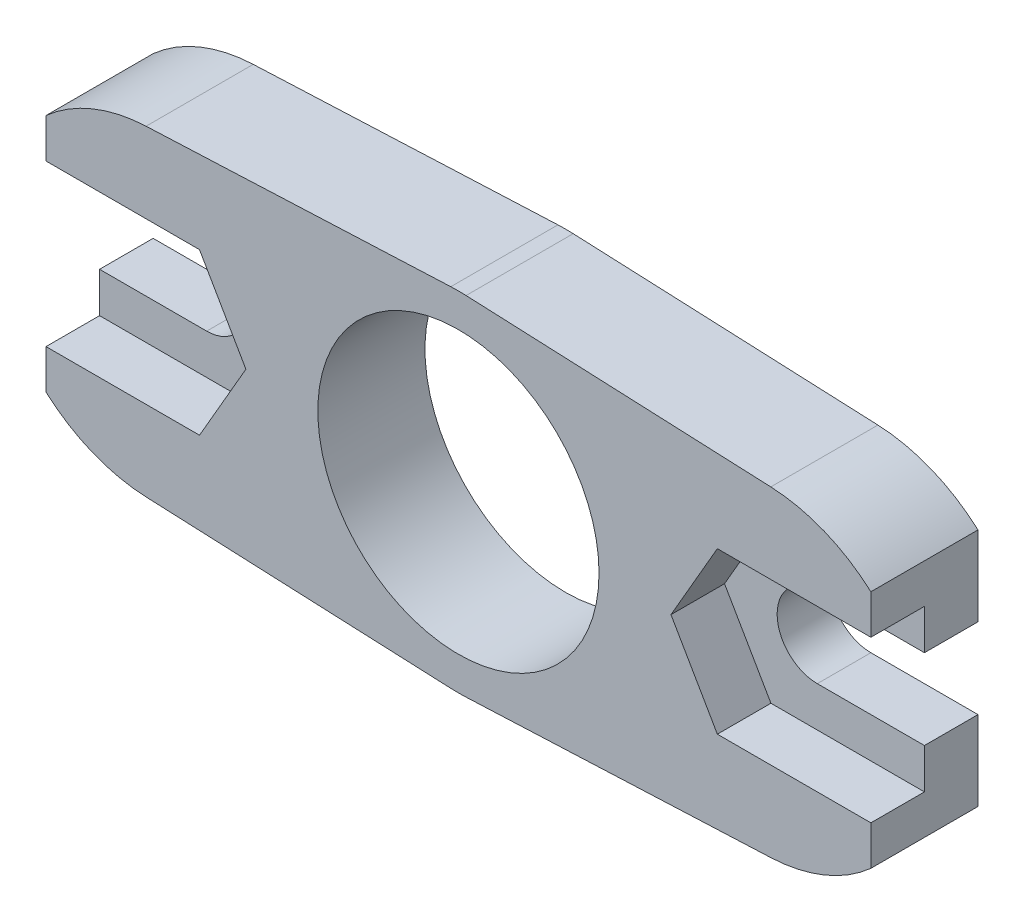
ISO-10303-21;
HEADER;
FILE_DESCRIPTION(('STEP AP214'),'2;1');
FILE_NAME('part.step','',(''),(''),'','','');
FILE_SCHEMA(('AUTOMOTIVE_DESIGN { 1 0 10303 214 1 1 1 1 }'));
ENDSEC;
DATA;
#1=APPLICATION_CONTEXT('core data for automotive mechanical design processes');
#2=APPLICATION_PROTOCOL_DEFINITION('international standard','automotive_design',2000,#1);
#3=PRODUCT_CONTEXT('',#1,'mechanical');
#4=PRODUCT('Part','Part','',(#3));
#5=PRODUCT_RELATED_PRODUCT_CATEGORY('part','',(#4));
#6=PRODUCT_DEFINITION_FORMATION('','',#4);
#7=PRODUCT_DEFINITION_CONTEXT('part definition',#1,'design');
#8=PRODUCT_DEFINITION('design','',#6,#7);
#9=PRODUCT_DEFINITION_SHAPE('','',#8);
#10=(LENGTH_UNIT() NAMED_UNIT(*) SI_UNIT(.MILLI.,.METRE.));
#11=(NAMED_UNIT(*) PLANE_ANGLE_UNIT() SI_UNIT($,.RADIAN.));
#12=(NAMED_UNIT(*) SI_UNIT($,.STERADIAN.) SOLID_ANGLE_UNIT());
#13=UNCERTAINTY_MEASURE_WITH_UNIT(LENGTH_MEASURE(1.E-05),#10,'distance_accuracy_value','');
#14=(GEOMETRIC_REPRESENTATION_CONTEXT(3) GLOBAL_UNCERTAINTY_ASSIGNED_CONTEXT((#13)) GLOBAL_UNIT_ASSIGNED_CONTEXT((#10,
#11,#12)) REPRESENTATION_CONTEXT('',''));
#15=CARTESIAN_POINT('',(0.,0.,0.));
#16=DIRECTION('',(0.,0.,1.));
#17=DIRECTION('',(1.,0.,0.));
#18=AXIS2_PLACEMENT_3D('',#15,#16,#17);
#19=CARTESIAN_POINT('',(-159.4,-141.5,6.));
#20=DIRECTION('',(0.,0.,-1.));
#21=DIRECTION('',(-1.,0.,0.));
#22=AXIS2_PLACEMENT_3D('',#19,#20,#21);
#23=CYLINDRICAL_SURFACE('',#22,1.49999999999999);
#24=DIRECTION('',(0.,0.,-1.));
#25=VECTOR('',#24,1.);
#26=CARTESIAN_POINT('',(-159.4,-140.,6.));
#27=LINE('',#26,#25);
#28=CARTESIAN_POINT('',(-159.4,-140.,4.));
#29=VERTEX_POINT('',#28);
#30=CARTESIAN_POINT('',(-159.4,-140.,2.));
#31=VERTEX_POINT('',#30);
#32=EDGE_CURVE('E430',#29,#31,#27,.T.);
#33=ORIENTED_EDGE('',*,*,#32,.T.);
#34=CARTESIAN_POINT('',(-159.4,-141.5,2.));
#35=DIRECTION('',(0.,0.,1.));
#36=DIRECTION('',(0.,-1.,0.));
#37=AXIS2_PLACEMENT_3D('',#34,#35,#36);
#38=CIRCLE('',#37,1.49999999999999);
#39=CARTESIAN_POINT('',(-159.4,-143.,2.));
#40=VERTEX_POINT('',#39);
#41=EDGE_CURVE('E308',#31,#40,#38,.F.);
#42=ORIENTED_EDGE('',*,*,#41,.T.);
#43=DIRECTION('',(0.,0.,-1.));
#44=VECTOR('',#43,1.);
#45=CARTESIAN_POINT('',(-159.4,-143.,6.));
#46=LINE('',#45,#44);
#47=CARTESIAN_POINT('',(-159.4,-143.,4.));
#48=VERTEX_POINT('',#47);
#49=EDGE_CURVE('E11',#48,#40,#46,.T.);
#50=ORIENTED_EDGE('',*,*,#49,.F.);
#51=CARTESIAN_POINT('',(-159.4,-141.5,4.));
#52=DIRECTION('',(0.,0.,1.));
#53=DIRECTION('',(1.,0.,0.));
#54=AXIS2_PLACEMENT_3D('',#51,#52,#53);
#55=CIRCLE('',#54,1.49999999999999);
#56=EDGE_CURVE('E329',#29,#48,#55,.F.);
#57=ORIENTED_EDGE('',*,*,#56,.F.);
#58=EDGE_LOOP('',(#33,#42,#50,#57));
#59=FACE_BOUND('',#58,.T.);
#60=ADVANCED_FACE('F34',(#59),#23,.F.);
#61=CARTESIAN_POINT('',(-163.4,-143.,6.));
#62=DIRECTION('',(0.,-1.,0.));
#63=DIRECTION('',(1.,0.,0.));
#64=AXIS2_PLACEMENT_3D('',#61,#62,#63);
#65=PLANE('',#64);
#66=ORIENTED_EDGE('',*,*,#49,.T.);
#67=DIRECTION('',(-1.,0.,0.));
#68=VECTOR('',#67,1.);
#69=CARTESIAN_POINT('',(-163.4,-143.,2.));
#70=LINE('',#69,#68);
#71=CARTESIAN_POINT('',(-163.4,-143.,2.));
#72=VERTEX_POINT('',#71);
#73=EDGE_CURVE('E306',#40,#72,#70,.T.);
#74=ORIENTED_EDGE('',*,*,#73,.T.);
#75=DIRECTION('',(0.,0.,-1.));
#76=VECTOR('',#75,1.);
#77=CARTESIAN_POINT('',(-163.4,-143.,6.));
#78=LINE('',#77,#76);
#79=CARTESIAN_POINT('',(-163.4,-143.,4.));
#80=VERTEX_POINT('',#79);
#81=EDGE_CURVE('E42',#80,#72,#78,.T.);
#82=ORIENTED_EDGE('',*,*,#81,.F.);
#83=DIRECTION('',(-1.,0.,0.));
#84=VECTOR('',#83,1.);
#85=CARTESIAN_POINT('',(-148.,-143.,4.));
#86=LINE('',#85,#84);
#87=EDGE_CURVE('E304',#48,#80,#86,.T.);
#88=ORIENTED_EDGE('',*,*,#87,.F.);
#89=EDGE_LOOP('',(#66,#74,#82,#88));
#90=FACE_BOUND('',#89,.T.);
#91=ADVANCED_FACE('F303',(#90),#65,.F.);
#92=CARTESIAN_POINT('',(-159.4,-140.,6.));
#93=DIRECTION('',(0.,1.,0.));
#94=DIRECTION('',(0.,0.,1.));
#95=AXIS2_PLACEMENT_3D('',#92,#93,#94);
#96=PLANE('',#95);
#97=DIRECTION('',(0.,0.,-1.));
#98=VECTOR('',#97,1.);
#99=CARTESIAN_POINT('',(-163.4,-140.,6.));
#100=LINE('',#99,#98);
#101=CARTESIAN_POINT('',(-163.4,-140.,4.));
#102=VERTEX_POINT('',#101);
#103=CARTESIAN_POINT('',(-163.4,-140.,2.));
#104=VERTEX_POINT('',#103);
#105=EDGE_CURVE('E433',#102,#104,#100,.T.);
#106=ORIENTED_EDGE('',*,*,#105,.T.);
#107=DIRECTION('',(1.,0.,0.));
#108=VECTOR('',#107,1.);
#109=CARTESIAN_POINT('',(-159.4,-140.,2.));
#110=LINE('',#109,#108);
#111=EDGE_CURVE('E49',#104,#31,#110,.T.);
#112=ORIENTED_EDGE('',*,*,#111,.T.);
#113=ORIENTED_EDGE('',*,*,#32,.F.);
#114=DIRECTION('',(1.,0.,0.));
#115=VECTOR('',#114,1.);
#116=CARTESIAN_POINT('',(-148.,-140.,4.));
#117=LINE('',#116,#115);
#118=EDGE_CURVE('E327',#102,#29,#117,.T.);
#119=ORIENTED_EDGE('',*,*,#118,.F.);
#120=EDGE_LOOP('',(#106,#112,#113,#119));
#121=FACE_BOUND('',#120,.T.);
#122=ADVANCED_FACE('F483',(#121),#96,.F.);
#123=CARTESIAN_POINT('',(-136.6,-143.,6.));
#124=DIRECTION('',(0.,-1.,0.));
#125=DIRECTION('',(0.,0.,-1.));
#126=AXIS2_PLACEMENT_3D('',#123,#124,#125);
#127=PLANE('',#126);
#128=DIRECTION('',(0.,0.,-1.));
#129=VECTOR('',#128,1.);
#130=CARTESIAN_POINT('',(-132.6,-143.,6.));
#131=LINE('',#130,#129);
#132=CARTESIAN_POINT('',(-132.6,-143.,4.));
#133=VERTEX_POINT('',#132);
#134=CARTESIAN_POINT('',(-132.6,-143.,2.));
#135=VERTEX_POINT('',#134);
#136=EDGE_CURVE('E270',#133,#135,#131,.T.);
#137=ORIENTED_EDGE('',*,*,#136,.T.);
#138=DIRECTION('',(-1.,0.,0.));
#139=VECTOR('',#138,1.);
#140=CARTESIAN_POINT('',(-136.6,-143.,2.));
#141=LINE('',#140,#139);
#142=CARTESIAN_POINT('',(-136.6,-143.,2.));
#143=VERTEX_POINT('',#142);
#144=EDGE_CURVE('E479',#135,#143,#141,.T.);
#145=ORIENTED_EDGE('',*,*,#144,.T.);
#146=DIRECTION('',(0.,0.,-1.));
#147=VECTOR('',#146,1.);
#148=CARTESIAN_POINT('',(-136.6,-143.,6.));
#149=LINE('',#148,#147);
#150=CARTESIAN_POINT('',(-136.6,-143.,4.));
#151=VERTEX_POINT('',#150);
#152=EDGE_CURVE('E267',#151,#143,#149,.T.);
#153=ORIENTED_EDGE('',*,*,#152,.F.);
#154=DIRECTION('',(-1.,0.,0.));
#155=VECTOR('',#154,1.);
#156=CARTESIAN_POINT('',(-148.,-143.,4.));
#157=LINE('',#156,#155);
#158=EDGE_CURVE('E372',#133,#151,#157,.T.);
#159=ORIENTED_EDGE('',*,*,#158,.F.);
#160=EDGE_LOOP('',(#137,#145,#153,#159));
#161=FACE_BOUND('',#160,.T.);
#162=ADVANCED_FACE('F532',(#161),#127,.F.);
#163=CARTESIAN_POINT('',(-136.6,-141.5,6.));
#164=DIRECTION('',(0.,0.,-1.));
#165=DIRECTION('',(-1.,0.,0.));
#166=AXIS2_PLACEMENT_3D('',#163,#164,#165);
#167=CYLINDRICAL_SURFACE('',#166,1.5);
#168=ORIENTED_EDGE('',*,*,#152,.T.);
#169=CARTESIAN_POINT('',(-136.6,-141.5,2.));
#170=DIRECTION('',(0.,0.,1.));
#171=DIRECTION('',(0.,-1.,0.));
#172=AXIS2_PLACEMENT_3D('',#169,#170,#171);
#173=CIRCLE('',#172,1.5);
#174=CARTESIAN_POINT('',(-136.6,-140.,2.));
#175=VERTEX_POINT('',#174);
#176=EDGE_CURVE('E476',#143,#175,#173,.F.);
#177=ORIENTED_EDGE('',*,*,#176,.T.);
#178=DIRECTION('',(0.,0.,-1.));
#179=VECTOR('',#178,1.);
#180=CARTESIAN_POINT('',(-136.6,-140.,6.));
#181=LINE('',#180,#179);
#182=CARTESIAN_POINT('',(-136.6,-140.,4.));
#183=VERTEX_POINT('',#182);
#184=EDGE_CURVE('E259',#183,#175,#181,.T.);
#185=ORIENTED_EDGE('',*,*,#184,.F.);
#186=CARTESIAN_POINT('',(-136.6,-141.5,4.));
#187=DIRECTION('',(0.,0.,1.));
#188=DIRECTION('',(1.,0.,0.));
#189=AXIS2_PLACEMENT_3D('',#186,#187,#188);
#190=CIRCLE('',#189,1.5);
#191=EDGE_CURVE('E374',#151,#183,#190,.F.);
#192=ORIENTED_EDGE('',*,*,#191,.F.);
#193=EDGE_LOOP('',(#168,#177,#185,#192));
#194=FACE_BOUND('',#193,.T.);
#195=ADVANCED_FACE('F528',(#194),#167,.F.);
#196=CARTESIAN_POINT('',(-136.6,-140.,6.));
#197=DIRECTION('',(0.,1.,0.));
#198=DIRECTION('',(0.,0.,1.));
#199=AXIS2_PLACEMENT_3D('',#196,#197,#198);
#200=PLANE('',#199);
#201=ORIENTED_EDGE('',*,*,#184,.T.);
#202=DIRECTION('',(1.,0.,0.));
#203=VECTOR('',#202,1.);
#204=CARTESIAN_POINT('',(-136.6,-140.,2.));
#205=LINE('',#204,#203);
#206=CARTESIAN_POINT('',(-132.6,-140.,2.));
#207=VERTEX_POINT('',#206);
#208=EDGE_CURVE('E474',#175,#207,#205,.T.);
#209=ORIENTED_EDGE('',*,*,#208,.T.);
#210=DIRECTION('',(0.,0.,-1.));
#211=VECTOR('',#210,1.);
#212=CARTESIAN_POINT('',(-132.6,-140.,6.));
#213=LINE('',#212,#211);
#214=CARTESIAN_POINT('',(-132.6,-140.,4.));
#215=VERTEX_POINT('',#214);
#216=EDGE_CURVE('E251',#215,#207,#213,.T.);
#217=ORIENTED_EDGE('',*,*,#216,.F.);
#218=DIRECTION('',(1.,0.,0.));
#219=VECTOR('',#218,1.);
#220=CARTESIAN_POINT('',(-148.,-140.,4.));
#221=LINE('',#220,#219);
#222=EDGE_CURVE('E376',#183,#215,#221,.T.);
#223=ORIENTED_EDGE('',*,*,#222,.F.);
#224=EDGE_LOOP('',(#201,#209,#217,#223));
#225=FACE_BOUND('',#224,.T.);
#226=ADVANCED_FACE('F526',(#225),#200,.F.);
#227=CARTESIAN_POINT('',(-163.4,-143.,6.));
#228=DIRECTION('',(1.,0.,0.));
#229=DIRECTION('',(0.,1.,0.));
#230=AXIS2_PLACEMENT_3D('',#227,#228,#229);
#231=PLANE('',#230);
#232=ORIENTED_EDGE('',*,*,#81,.T.);
#233=DIRECTION('',(0.,-1.,0.));
#234=VECTOR('',#233,1.);
#235=CARTESIAN_POINT('',(-163.4,-134.006254933222,2.));
#236=LINE('',#235,#234);
#237=CARTESIAN_POINT('',(-163.4,-145.972135955,2.));
#238=VERTEX_POINT('',#237);
#239=EDGE_CURVE('E252',#72,#238,#236,.T.);
#240=ORIENTED_EDGE('',*,*,#239,.T.);
#241=DIRECTION('',(0.,0.,-1.));
#242=VECTOR('',#241,1.);
#243=CARTESIAN_POINT('',(-163.4,-145.972135955,6.));
#244=LINE('',#243,#242);
#245=CARTESIAN_POINT('',(-163.4,-145.972135955,6.));
#246=VERTEX_POINT('',#245);
#247=EDGE_CURVE('E288',#246,#238,#244,.T.);
#248=ORIENTED_EDGE('',*,*,#247,.F.);
#249=DIRECTION('',(0.,-1.,0.));
#250=VECTOR('',#249,1.);
#251=CARTESIAN_POINT('',(-163.4,-143.,6.));
#252=LINE('',#251,#250);
#253=CARTESIAN_POINT('',(-163.4,-144.5,6.));
#254=VERTEX_POINT('',#253);
#255=EDGE_CURVE('E401',#254,#246,#252,.T.);
#256=ORIENTED_EDGE('',*,*,#255,.F.);
#257=DIRECTION('',(0.,0.,1.));
#258=VECTOR('',#257,1.);
#259=CARTESIAN_POINT('',(-163.4,-144.5,4.));
#260=LINE('',#259,#258);
#261=CARTESIAN_POINT('',(-163.4,-144.5,4.));
#262=VERTEX_POINT('',#261);
#263=EDGE_CURVE('E346',#262,#254,#260,.T.);
#264=ORIENTED_EDGE('',*,*,#263,.F.);
#265=DIRECTION('',(0.,-1.,0.));
#266=VECTOR('',#265,1.);
#267=CARTESIAN_POINT('',(-163.4,-167.644732683835,4.));
#268=LINE('',#267,#266);
#269=EDGE_CURVE('E299',#80,#262,#268,.T.);
#270=ORIENTED_EDGE('',*,*,#269,.F.);
#271=EDGE_LOOP('',(#232,#240,#248,#256,#264,#270));
#272=FACE_BOUND('',#271,.T.);
#273=ADVANCED_FACE('F296',(#272),#231,.F.);
#274=CARTESIAN_POINT('',(-159.4,-141.5,6.));
#275=DIRECTION('',(0.,0.,-1.));
#276=DIRECTION('',(-1.,0.,0.));
#277=AXIS2_PLACEMENT_3D('',#274,#275,#276);
#278=CYLINDRICAL_SURFACE('',#277,5.99999999999998);
#279=ORIENTED_EDGE('',*,*,#247,.T.);
#280=CARTESIAN_POINT('',(-159.4,-141.5,2.));
#281=DIRECTION('',(0.,0.,1.));
#282=DIRECTION('',(0.,-1.,0.));
#283=AXIS2_PLACEMENT_3D('',#280,#281,#282);
#284=CIRCLE('',#283,5.99999999999998);
#285=CARTESIAN_POINT('',(-159.663157894737,-147.494226215488,2.));
#286=VERTEX_POINT('',#285);
#287=EDGE_CURVE('E471',#238,#286,#284,.T.);
#288=ORIENTED_EDGE('',*,*,#287,.T.);
#289=DIRECTION('',(0.,0.,-1.));
#290=VECTOR('',#289,1.);
#291=CARTESIAN_POINT('',(-159.663157894737,-147.494226215488,6.));
#292=LINE('',#291,#290);
#293=CARTESIAN_POINT('',(-159.663157894737,-147.494226215488,6.));
#294=VERTEX_POINT('',#293);
#295=EDGE_CURVE('E285',#294,#286,#292,.T.);
#296=ORIENTED_EDGE('',*,*,#295,.F.);
#297=CARTESIAN_POINT('',(-159.4,-141.5,6.));
#298=DIRECTION('',(0.,0.,1.));
#299=DIRECTION('',(1.,0.,0.));
#300=AXIS2_PLACEMENT_3D('',#297,#298,#299);
#301=CIRCLE('',#300,5.99999999999998);
#302=EDGE_CURVE('E403',#246,#294,#301,.T.);
#303=ORIENTED_EDGE('',*,*,#302,.F.);
#304=EDGE_LOOP('',(#279,#288,#296,#303));
#305=FACE_BOUND('',#304,.T.);
#306=ADVANCED_FACE('F557',(#305),#278,.T.);
#307=CARTESIAN_POINT('',(-148.285087719298,-147.993745066778,6.));
#308=DIRECTION('',(0.0438596491228046,0.999037702581251,0.));
#309=DIRECTION('',(-0.999037702581251,0.0438596491228046,0.));
#310=AXIS2_PLACEMENT_3D('',#307,#308,#309);
#311=PLANE('',#310);
#312=ORIENTED_EDGE('',*,*,#295,.T.);
#313=DIRECTION('',(0.999037702581251,-0.0438596491228046,0.));
#314=VECTOR('',#313,1.);
#315=CARTESIAN_POINT('',(-148.285087719298,-147.993745066778,2.));
#316=LINE('',#315,#314);
#317=CARTESIAN_POINT('',(-148.285087719298,-147.993745066778,2.));
#318=VERTEX_POINT('',#317);
#319=EDGE_CURVE('E468',#286,#318,#316,.T.);
#320=ORIENTED_EDGE('',*,*,#319,.T.);
#321=DIRECTION('',(0.,0.,-1.));
#322=VECTOR('',#321,1.);
#323=CARTESIAN_POINT('',(-148.285087719298,-147.993745066778,6.));
#324=LINE('',#323,#322);
#325=CARTESIAN_POINT('',(-148.285087719298,-147.993745066778,6.));
#326=VERTEX_POINT('',#325);
#327=EDGE_CURVE('E282',#326,#318,#324,.T.);
#328=ORIENTED_EDGE('',*,*,#327,.F.);
#329=DIRECTION('',(0.999037702581251,-0.0438596491228046,0.));
#330=VECTOR('',#329,1.);
#331=CARTESIAN_POINT('',(-148.285087719298,-147.993745066778,6.));
#332=LINE('',#331,#330);
#333=EDGE_CURVE('E405',#294,#326,#332,.T.);
#334=ORIENTED_EDGE('',*,*,#333,.F.);
#335=EDGE_LOOP('',(#312,#320,#328,#334));
#336=FACE_BOUND('',#335,.T.);
#337=ADVANCED_FACE('F554',(#336),#311,.F.);
#338=CARTESIAN_POINT('',(-148.,-141.5,6.));
#339=DIRECTION('',(0.,0.,-1.));
#340=DIRECTION('',(-1.,0.,0.));
#341=AXIS2_PLACEMENT_3D('',#338,#339,#340);
#342=CYLINDRICAL_SURFACE('',#341,6.5);
#343=ORIENTED_EDGE('',*,*,#327,.T.);
#344=CARTESIAN_POINT('',(-148.,-141.5,2.));
#345=DIRECTION('',(0.,0.,1.));
#346=DIRECTION('',(0.,-1.,0.));
#347=AXIS2_PLACEMENT_3D('',#344,#345,#346);
#348=CIRCLE('',#347,6.5);
#349=CARTESIAN_POINT('',(-147.714912280702,-147.993745066778,2.));
#350=VERTEX_POINT('',#349);
#351=EDGE_CURVE('E465',#318,#350,#348,.T.);
#352=ORIENTED_EDGE('',*,*,#351,.T.);
#353=DIRECTION('',(0.,0.,-1.));
#354=VECTOR('',#353,1.);
#355=CARTESIAN_POINT('',(-147.714912280702,-147.993745066778,6.));
#356=LINE('',#355,#354);
#357=CARTESIAN_POINT('',(-147.714912280702,-147.993745066778,6.));
#358=VERTEX_POINT('',#357);
#359=EDGE_CURVE('E279',#358,#350,#356,.T.);
#360=ORIENTED_EDGE('',*,*,#359,.F.);
#361=CARTESIAN_POINT('',(-148.,-141.5,6.));
#362=DIRECTION('',(0.,0.,1.));
#363=DIRECTION('',(1.,0.,0.));
#364=AXIS2_PLACEMENT_3D('',#361,#362,#363);
#365=CIRCLE('',#364,6.5);
#366=EDGE_CURVE('E407',#326,#358,#365,.T.);
#367=ORIENTED_EDGE('',*,*,#366,.F.);
#368=EDGE_LOOP('',(#343,#352,#360,#367));
#369=FACE_BOUND('',#368,.T.);
#370=ADVANCED_FACE('F549',(#369),#342,.T.);
#371=CARTESIAN_POINT('',(-136.336842105263,-147.494226215488,6.));
#372=DIRECTION('',(-0.043859649122807,0.999037702581251,0.));
#373=DIRECTION('',(-0.999037702581251,-0.043859649122807,0.));
#374=AXIS2_PLACEMENT_3D('',#371,#372,#373);
#375=PLANE('',#374);
#376=ORIENTED_EDGE('',*,*,#359,.T.);
#377=DIRECTION('',(0.999037702581251,0.043859649122807,0.));
#378=VECTOR('',#377,1.);
#379=CARTESIAN_POINT('',(-136.336842105263,-147.494226215488,2.));
#380=LINE('',#379,#378);
#381=CARTESIAN_POINT('',(-136.336842105263,-147.494226215488,2.));
#382=VERTEX_POINT('',#381);
#383=EDGE_CURVE('E462',#350,#382,#380,.T.);
#384=ORIENTED_EDGE('',*,*,#383,.T.);
#385=DIRECTION('',(0.,0.,-1.));
#386=VECTOR('',#385,1.);
#387=CARTESIAN_POINT('',(-136.336842105263,-147.494226215488,6.));
#388=LINE('',#387,#386);
#389=CARTESIAN_POINT('',(-136.336842105263,-147.494226215488,6.));
#390=VERTEX_POINT('',#389);
#391=EDGE_CURVE('E276',#390,#382,#388,.T.);
#392=ORIENTED_EDGE('',*,*,#391,.F.);
#393=DIRECTION('',(0.999037702581251,0.043859649122807,0.));
#394=VECTOR('',#393,1.);
#395=CARTESIAN_POINT('',(-136.336842105263,-147.494226215488,6.));
#396=LINE('',#395,#394);
#397=EDGE_CURVE('E409',#358,#390,#396,.T.);
#398=ORIENTED_EDGE('',*,*,#397,.F.);
#399=EDGE_LOOP('',(#376,#384,#392,#398));
#400=FACE_BOUND('',#399,.T.);
#401=ADVANCED_FACE('F546',(#400),#375,.F.);
#402=CARTESIAN_POINT('',(-136.6,-141.5,6.));
#403=DIRECTION('',(0.,0.,-1.));
#404=DIRECTION('',(-1.,0.,0.));
#405=AXIS2_PLACEMENT_3D('',#402,#403,#404);
#406=CYLINDRICAL_SURFACE('',#405,6.00000000000003);
#407=ORIENTED_EDGE('',*,*,#391,.T.);
#408=CARTESIAN_POINT('',(-136.6,-141.5,2.));
#409=DIRECTION('',(0.,0.,1.));
#410=DIRECTION('',(0.,-1.,0.));
#411=AXIS2_PLACEMENT_3D('',#408,#409,#410);
#412=CIRCLE('',#411,6.00000000000003);
#413=CARTESIAN_POINT('',(-132.6,-145.972135955,2.));
#414=VERTEX_POINT('',#413);
#415=EDGE_CURVE('E240',#382,#414,#412,.T.);
#416=ORIENTED_EDGE('',*,*,#415,.T.);
#417=DIRECTION('',(0.,0.,-1.));
#418=VECTOR('',#417,1.);
#419=CARTESIAN_POINT('',(-132.6,-145.972135955,6.));
#420=LINE('',#419,#418);
#421=CARTESIAN_POINT('',(-132.6,-145.972135955,6.));
#422=VERTEX_POINT('',#421);
#423=EDGE_CURVE('E273',#422,#414,#420,.T.);
#424=ORIENTED_EDGE('',*,*,#423,.F.);
#425=CARTESIAN_POINT('',(-136.6,-141.5,6.));
#426=DIRECTION('',(0.,0.,1.));
#427=DIRECTION('',(1.,0.,0.));
#428=AXIS2_PLACEMENT_3D('',#425,#426,#427);
#429=CIRCLE('',#428,6.00000000000003);
#430=EDGE_CURVE('E411',#390,#422,#429,.T.);
#431=ORIENTED_EDGE('',*,*,#430,.F.);
#432=EDGE_LOOP('',(#407,#416,#424,#431));
#433=FACE_BOUND('',#432,.T.);
#434=ADVANCED_FACE('F541',(#433),#406,.T.);
#435=CARTESIAN_POINT('',(-132.6,-145.972135955,6.));
#436=DIRECTION('',(-1.,0.,0.));
#437=DIRECTION('',(0.,0.,1.));
#438=AXIS2_PLACEMENT_3D('',#435,#436,#437);
#439=PLANE('',#438);
#440=ORIENTED_EDGE('',*,*,#423,.T.);
#441=DIRECTION('',(0.,-1.,0.));
#442=VECTOR('',#441,1.);
#443=CARTESIAN_POINT('',(-132.6,-134.006254933222,2.));
#444=LINE('',#443,#442);
#445=EDGE_CURVE('E253',#135,#414,#444,.T.);
#446=ORIENTED_EDGE('',*,*,#445,.F.);
#447=ORIENTED_EDGE('',*,*,#136,.F.);
#448=DIRECTION('',(0.,1.,0.));
#449=VECTOR('',#448,1.);
#450=CARTESIAN_POINT('',(-132.6,-167.644732683836,4.));
#451=LINE('',#450,#449);
#452=CARTESIAN_POINT('',(-132.6,-144.5,4.));
#453=VERTEX_POINT('',#452);
#454=EDGE_CURVE('E370',#453,#133,#451,.T.);
#455=ORIENTED_EDGE('',*,*,#454,.F.);
#456=DIRECTION('',(0.,0.,1.));
#457=VECTOR('',#456,1.);
#458=CARTESIAN_POINT('',(-132.6,-144.5,4.));
#459=LINE('',#458,#457);
#460=CARTESIAN_POINT('',(-132.6,-144.5,6.));
#461=VERTEX_POINT('',#460);
#462=EDGE_CURVE('E388',#453,#461,#459,.T.);
#463=ORIENTED_EDGE('',*,*,#462,.T.);
#464=DIRECTION('',(0.,1.,0.));
#465=VECTOR('',#464,1.);
#466=CARTESIAN_POINT('',(-132.6,-145.972135955,6.));
#467=LINE('',#466,#465);
#468=EDGE_CURVE('E413',#422,#461,#467,.T.);
#469=ORIENTED_EDGE('',*,*,#468,.F.);
#470=EDGE_LOOP('',(#440,#446,#447,#455,#463,#469));
#471=FACE_BOUND('',#470,.T.);
#472=ADVANCED_FACE('F537',(#471),#439,.F.);
#473=CARTESIAN_POINT('',(-132.6,-140.,6.));
#474=DIRECTION('',(-1.,0.,0.));
#475=DIRECTION('',(0.,-1.,0.));
#476=AXIS2_PLACEMENT_3D('',#473,#474,#475);
#477=PLANE('',#476);
#478=ORIENTED_EDGE('',*,*,#216,.T.);
#479=CARTESIAN_POINT('',(-132.6,-137.027864045,2.));
#480=VERTEX_POINT('',#479);
#481=EDGE_CURVE('E232',#480,#207,#444,.T.);
#482=ORIENTED_EDGE('',*,*,#481,.F.);
#483=DIRECTION('',(0.,0.,-1.));
#484=VECTOR('',#483,1.);
#485=CARTESIAN_POINT('',(-132.6,-137.027864045,6.));
#486=LINE('',#485,#484);
#487=CARTESIAN_POINT('',(-132.6,-137.027864045,6.));
#488=VERTEX_POINT('',#487);
#489=EDGE_CURVE('E247',#488,#480,#486,.T.);
#490=ORIENTED_EDGE('',*,*,#489,.F.);
#491=DIRECTION('',(0.,1.,0.));
#492=VECTOR('',#491,1.);
#493=CARTESIAN_POINT('',(-132.6,-140.,6.));
#494=LINE('',#493,#492);
#495=CARTESIAN_POINT('',(-132.6,-138.5,6.));
#496=VERTEX_POINT('',#495);
#497=EDGE_CURVE('E416',#496,#488,#494,.T.);
#498=ORIENTED_EDGE('',*,*,#497,.F.);
#499=DIRECTION('',(0.,0.,1.));
#500=VECTOR('',#499,1.);
#501=CARTESIAN_POINT('',(-132.6,-138.5,4.));
#502=LINE('',#501,#500);
#503=CARTESIAN_POINT('',(-132.6,-138.5,4.));
#504=VERTEX_POINT('',#503);
#505=EDGE_CURVE('E378',#504,#496,#502,.T.);
#506=ORIENTED_EDGE('',*,*,#505,.F.);
#507=DIRECTION('',(0.,1.,0.));
#508=VECTOR('',#507,1.);
#509=CARTESIAN_POINT('',(-132.6,-167.644732683835,4.));
#510=LINE('',#509,#508);
#511=EDGE_CURVE('E354',#215,#504,#510,.T.);
#512=ORIENTED_EDGE('',*,*,#511,.F.);
#513=EDGE_LOOP('',(#478,#482,#490,#498,#506,#512));
#514=FACE_BOUND('',#513,.T.);
#515=ADVANCED_FACE('F245',(#514),#477,.F.);
#516=CARTESIAN_POINT('',(-136.6,-141.5,6.));
#517=DIRECTION('',(0.,0.,-1.));
#518=DIRECTION('',(-1.,0.,0.));
#519=AXIS2_PLACEMENT_3D('',#516,#517,#518);
#520=CYLINDRICAL_SURFACE('',#519,6.00000000000003);
#521=ORIENTED_EDGE('',*,*,#489,.T.);
#522=CARTESIAN_POINT('',(-136.6,-141.5,2.));
#523=DIRECTION('',(0.,0.,1.));
#524=DIRECTION('',(0.,-1.,0.));
#525=AXIS2_PLACEMENT_3D('',#522,#523,#524);
#526=CIRCLE('',#525,6.00000000000003);
#527=CARTESIAN_POINT('',(-136.336842105263,-135.505773784512,2.));
#528=VERTEX_POINT('',#527);
#529=EDGE_CURVE('E229',#480,#528,#526,.T.);
#530=ORIENTED_EDGE('',*,*,#529,.T.);
#531=DIRECTION('',(0.,0.,-1.));
#532=VECTOR('',#531,1.);
#533=CARTESIAN_POINT('',(-136.336842105263,-135.505773784512,6.));
#534=LINE('',#533,#532);
#535=CARTESIAN_POINT('',(-136.336842105263,-135.505773784512,6.));
#536=VERTEX_POINT('',#535);
#537=EDGE_CURVE('E257',#536,#528,#534,.T.);
#538=ORIENTED_EDGE('',*,*,#537,.F.);
#539=CARTESIAN_POINT('',(-136.6,-141.5,6.));
#540=DIRECTION('',(0.,0.,1.));
#541=DIRECTION('',(1.,0.,0.));
#542=AXIS2_PLACEMENT_3D('',#539,#540,#541);
#543=CIRCLE('',#542,6.00000000000003);
#544=EDGE_CURVE('E256',#488,#536,#543,.T.);
#545=ORIENTED_EDGE('',*,*,#544,.F.);
#546=EDGE_LOOP('',(#521,#530,#538,#545));
#547=FACE_BOUND('',#546,.T.);
#548=ADVANCED_FACE('F255',(#547),#520,.T.);
#549=CARTESIAN_POINT('',(-147.714912280702,-135.006254933222,6.));
#550=DIRECTION('',(-0.043859649122807,-0.999037702581251,0.));
#551=DIRECTION('',(0.999037702581251,-0.043859649122807,0.));
#552=AXIS2_PLACEMENT_3D('',#549,#550,#551);
#553=PLANE('',#552);
#554=ORIENTED_EDGE('',*,*,#537,.T.);
#555=DIRECTION('',(-0.999037702581251,0.043859649122807,0.));
#556=VECTOR('',#555,1.);
#557=CARTESIAN_POINT('',(-147.714912280702,-135.006254933222,2.));
#558=LINE('',#557,#556);
#559=CARTESIAN_POINT('',(-147.714912280702,-135.006254933222,2.));
#560=VERTEX_POINT('',#559);
#561=EDGE_CURVE('E235',#528,#560,#558,.T.);
#562=ORIENTED_EDGE('',*,*,#561,.T.);
#563=DIRECTION('',(0.,0.,-1.));
#564=VECTOR('',#563,1.);
#565=CARTESIAN_POINT('',(-147.714912280702,-135.006254933222,6.));
#566=LINE('',#565,#564);
#567=CARTESIAN_POINT('',(-147.714912280702,-135.006254933222,6.));
#568=VERTEX_POINT('',#567);
#569=EDGE_CURVE('E261',#568,#560,#566,.T.);
#570=ORIENTED_EDGE('',*,*,#569,.F.);
#571=DIRECTION('',(-0.999037702581251,0.043859649122807,0.));
#572=VECTOR('',#571,1.);
#573=CARTESIAN_POINT('',(-147.714912280702,-135.006254933222,6.));
#574=LINE('',#573,#572);
#575=EDGE_CURVE('E419',#536,#568,#574,.T.);
#576=ORIENTED_EDGE('',*,*,#575,.F.);
#577=EDGE_LOOP('',(#554,#562,#570,#576));
#578=FACE_BOUND('',#577,.T.);
#579=ADVANCED_FACE('F454',(#578),#553,.F.);
#580=CARTESIAN_POINT('',(-148.,-141.5,6.));
#581=DIRECTION('',(0.,0.,-1.));
#582=DIRECTION('',(-1.,0.,0.));
#583=AXIS2_PLACEMENT_3D('',#580,#581,#582);
#584=CYLINDRICAL_SURFACE('',#583,6.50000000000002);
#585=ORIENTED_EDGE('',*,*,#569,.T.);
#586=CARTESIAN_POINT('',(-148.,-141.5,2.));
#587=DIRECTION('',(0.,0.,1.));
#588=DIRECTION('',(0.,-1.,0.));
#589=AXIS2_PLACEMENT_3D('',#586,#587,#588);
#590=CIRCLE('',#589,6.50000000000002);
#591=CARTESIAN_POINT('',(-148.285087719298,-135.006254933222,2.));
#592=VERTEX_POINT('',#591);
#593=EDGE_CURVE('E451',#560,#592,#590,.T.);
#594=ORIENTED_EDGE('',*,*,#593,.T.);
#595=DIRECTION('',(0.,0.,-1.));
#596=VECTOR('',#595,1.);
#597=CARTESIAN_POINT('',(-148.285087719298,-135.006254933222,6.));
#598=LINE('',#597,#596);
#599=CARTESIAN_POINT('',(-148.285087719298,-135.006254933222,6.));
#600=VERTEX_POINT('',#599);
#601=EDGE_CURVE('E442',#600,#592,#598,.T.);
#602=ORIENTED_EDGE('',*,*,#601,.F.);
#603=CARTESIAN_POINT('',(-148.,-141.5,6.));
#604=DIRECTION('',(0.,0.,1.));
#605=DIRECTION('',(1.,0.,0.));
#606=AXIS2_PLACEMENT_3D('',#603,#604,#605);
#607=CIRCLE('',#606,6.50000000000002);
#608=EDGE_CURVE('E421',#568,#600,#607,.T.);
#609=ORIENTED_EDGE('',*,*,#608,.F.);
#610=EDGE_LOOP('',(#585,#594,#602,#609));
#611=FACE_BOUND('',#610,.T.);
#612=ADVANCED_FACE('F449',(#611),#584,.T.);
#613=CARTESIAN_POINT('',(-159.663157894737,-135.505773784513,6.));
#614=DIRECTION('',(0.043859649122807,-0.999037702581251,0.));
#615=DIRECTION('',(0.999037702581251,0.043859649122807,0.));
#616=AXIS2_PLACEMENT_3D('',#613,#614,#615);
#617=PLANE('',#616);
#618=ORIENTED_EDGE('',*,*,#601,.T.);
#619=DIRECTION('',(-0.999037702581251,-0.043859649122807,0.));
#620=VECTOR('',#619,1.);
#621=CARTESIAN_POINT('',(-159.663157894737,-135.505773784513,2.));
#622=LINE('',#621,#620);
#623=CARTESIAN_POINT('',(-159.663157894737,-135.505773784513,2.));
#624=VERTEX_POINT('',#623);
#625=EDGE_CURVE('E456',#592,#624,#622,.T.);
#626=ORIENTED_EDGE('',*,*,#625,.T.);
#627=DIRECTION('',(0.,0.,-1.));
#628=VECTOR('',#627,1.);
#629=CARTESIAN_POINT('',(-159.663157894737,-135.505773784513,6.));
#630=LINE('',#629,#628);
#631=CARTESIAN_POINT('',(-159.663157894737,-135.505773784513,6.));
#632=VERTEX_POINT('',#631);
#633=EDGE_CURVE('E439',#632,#624,#630,.T.);
#634=ORIENTED_EDGE('',*,*,#633,.F.);
#635=DIRECTION('',(-0.999037702581251,-0.043859649122807,0.));
#636=VECTOR('',#635,1.);
#637=CARTESIAN_POINT('',(-159.663157894737,-135.505773784513,6.));
#638=LINE('',#637,#636);
#639=EDGE_CURVE('E423',#600,#632,#638,.T.);
#640=ORIENTED_EDGE('',*,*,#639,.F.);
#641=EDGE_LOOP('',(#618,#626,#634,#640));
#642=FACE_BOUND('',#641,.T.);
#643=ADVANCED_FACE('F504',(#642),#617,.F.);
#644=CARTESIAN_POINT('',(-159.4,-141.5,6.));
#645=DIRECTION('',(0.,0.,-1.));
#646=DIRECTION('',(-1.,0.,0.));
#647=AXIS2_PLACEMENT_3D('',#644,#645,#646);
#648=CYLINDRICAL_SURFACE('',#647,5.99999999999998);
#649=ORIENTED_EDGE('',*,*,#633,.T.);
#650=CARTESIAN_POINT('',(-159.4,-141.5,2.));
#651=DIRECTION('',(0.,0.,1.));
#652=DIRECTION('',(0.,-1.,0.));
#653=AXIS2_PLACEMENT_3D('',#650,#651,#652);
#654=CIRCLE('',#653,5.99999999999998);
#655=CARTESIAN_POINT('',(-163.4,-137.027864045,2.));
#656=VERTEX_POINT('',#655);
#657=EDGE_CURVE('E499',#624,#656,#654,.T.);
#658=ORIENTED_EDGE('',*,*,#657,.T.);
#659=DIRECTION('',(0.,0.,-1.));
#660=VECTOR('',#659,1.);
#661=CARTESIAN_POINT('',(-163.4,-137.027864045,6.));
#662=LINE('',#661,#660);
#663=CARTESIAN_POINT('',(-163.4,-137.027864045,6.));
#664=VERTEX_POINT('',#663);
#665=EDGE_CURVE('E436',#664,#656,#662,.T.);
#666=ORIENTED_EDGE('',*,*,#665,.F.);
#667=CARTESIAN_POINT('',(-159.4,-141.5,6.));
#668=DIRECTION('',(0.,0.,1.));
#669=DIRECTION('',(1.,0.,0.));
#670=AXIS2_PLACEMENT_3D('',#667,#668,#669);
#671=CIRCLE('',#670,5.99999999999998);
#672=EDGE_CURVE('E425',#632,#664,#671,.T.);
#673=ORIENTED_EDGE('',*,*,#672,.F.);
#674=EDGE_LOOP('',(#649,#658,#666,#673));
#675=FACE_BOUND('',#674,.T.);
#676=ADVANCED_FACE('F508',(#675),#648,.T.);
#677=CARTESIAN_POINT('',(-163.4,-137.027864045,6.));
#678=DIRECTION('',(1.,0.,0.));
#679=DIRECTION('',(0.,0.,-1.));
#680=AXIS2_PLACEMENT_3D('',#677,#678,#679);
#681=PLANE('',#680);
#682=ORIENTED_EDGE('',*,*,#665,.T.);
#683=EDGE_CURVE('E493',#656,#104,#236,.T.);
#684=ORIENTED_EDGE('',*,*,#683,.T.);
#685=ORIENTED_EDGE('',*,*,#105,.F.);
#686=DIRECTION('',(0.,-1.,0.));
#687=VECTOR('',#686,1.);
#688=CARTESIAN_POINT('',(-163.4,-167.644732683836,4.));
#689=LINE('',#688,#687);
#690=CARTESIAN_POINT('',(-163.4,-138.5,4.));
#691=VERTEX_POINT('',#690);
#692=EDGE_CURVE('E325',#691,#102,#689,.T.);
#693=ORIENTED_EDGE('',*,*,#692,.F.);
#694=DIRECTION('',(0.,0.,1.));
#695=VECTOR('',#694,1.);
#696=CARTESIAN_POINT('',(-163.4,-138.5,4.));
#697=LINE('',#696,#695);
#698=CARTESIAN_POINT('',(-163.4,-138.5,6.));
#699=VERTEX_POINT('',#698);
#700=EDGE_CURVE('E348',#691,#699,#697,.T.);
#701=ORIENTED_EDGE('',*,*,#700,.T.);
#702=DIRECTION('',(0.,-1.,0.));
#703=VECTOR('',#702,1.);
#704=CARTESIAN_POINT('',(-163.4,-137.027864045,6.));
#705=LINE('',#704,#703);
#706=EDGE_CURVE('E427',#664,#699,#705,.T.);
#707=ORIENTED_EDGE('',*,*,#706,.F.);
#708=EDGE_LOOP('',(#682,#684,#685,#693,#701,#707));
#709=FACE_BOUND('',#708,.T.);
#710=ADVANCED_FACE('F492',(#709),#681,.F.);
#711=CARTESIAN_POINT('',(-159.4,-141.5,6.));
#712=DIRECTION('',(0.,0.,1.));
#713=DIRECTION('',(1.,0.,0.));
#714=AXIS2_PLACEMENT_3D('',#711,#712,#713);
#715=PLANE('',#714);
#716=DIRECTION('',(1.,0.,0.));
#717=VECTOR('',#716,1.);
#718=CARTESIAN_POINT('',(-148.,-144.5,6.));
#719=LINE('',#718,#717);
#720=CARTESIAN_POINT('',(-157.667949192431,-144.5,6.));
#721=VERTEX_POINT('',#720);
#722=EDGE_CURVE('E319',#254,#721,#719,.T.);
#723=ORIENTED_EDGE('',*,*,#722,.F.);
#724=ORIENTED_EDGE('',*,*,#255,.T.);
#725=ORIENTED_EDGE('',*,*,#302,.T.);
#726=ORIENTED_EDGE('',*,*,#333,.T.);
#727=ORIENTED_EDGE('',*,*,#366,.T.);
#728=ORIENTED_EDGE('',*,*,#397,.T.);
#729=ORIENTED_EDGE('',*,*,#430,.T.);
#730=ORIENTED_EDGE('',*,*,#468,.T.);
#731=DIRECTION('',(1.,0.,0.));
#732=VECTOR('',#731,1.);
#733=CARTESIAN_POINT('',(-148.,-144.5,6.));
#734=LINE('',#733,#732);
#735=CARTESIAN_POINT('',(-138.332050807569,-144.5,6.));
#736=VERTEX_POINT('',#735);
#737=EDGE_CURVE('E358',#736,#461,#734,.T.);
#738=ORIENTED_EDGE('',*,*,#737,.F.);
#739=DIRECTION('',(0.499999999999998,-0.86602540378444,0.));
#740=VECTOR('',#739,1.);
#741=CARTESIAN_POINT('',(-130.727074871676,-157.672204711306,6.));
#742=LINE('',#741,#740);
#743=CARTESIAN_POINT('',(-140.064101615138,-141.5,6.));
#744=VERTEX_POINT('',#743);
#745=EDGE_CURVE('E384',#744,#736,#742,.T.);
#746=ORIENTED_EDGE('',*,*,#745,.F.);
#747=DIRECTION('',(-0.500000000000004,-0.866025403784436,0.));
#748=VECTOR('',#747,1.);
#749=CARTESIAN_POINT('',(-153.369077551031,-164.544894314448,6.));
#750=LINE('',#749,#748);
#751=CARTESIAN_POINT('',(-138.332050807569,-138.5,6.));
#752=VERTEX_POINT('',#751);
#753=EDGE_CURVE('E381',#752,#744,#750,.T.);
#754=ORIENTED_EDGE('',*,*,#753,.F.);
#755=DIRECTION('',(-1.,0.,0.));
#756=VECTOR('',#755,1.);
#757=CARTESIAN_POINT('',(-148.,-138.5,6.));
#758=LINE('',#757,#756);
#759=EDGE_CURVE('E345',#496,#752,#758,.T.);
#760=ORIENTED_EDGE('',*,*,#759,.F.);
#761=ORIENTED_EDGE('',*,*,#497,.T.);
#762=ORIENTED_EDGE('',*,*,#544,.T.);
#763=ORIENTED_EDGE('',*,*,#575,.T.);
#764=ORIENTED_EDGE('',*,*,#608,.T.);
#765=ORIENTED_EDGE('',*,*,#639,.T.);
#766=ORIENTED_EDGE('',*,*,#672,.T.);
#767=ORIENTED_EDGE('',*,*,#706,.T.);
#768=DIRECTION('',(-1.,0.,0.));
#769=VECTOR('',#768,1.);
#770=CARTESIAN_POINT('',(-148.,-138.5,6.));
#771=LINE('',#770,#769);
#772=CARTESIAN_POINT('',(-157.667949192431,-138.5,6.));
#773=VERTEX_POINT('',#772);
#774=EDGE_CURVE('E339',#773,#699,#771,.T.);
#775=ORIENTED_EDGE('',*,*,#774,.F.);
#776=DIRECTION('',(-0.499999999999993,0.866025403784443,0.));
#777=VECTOR('',#776,1.);
#778=CARTESIAN_POINT('',(-142.630922448969,-164.544894314448,6.));
#779=LINE('',#778,#777);
#780=CARTESIAN_POINT('',(-155.935898384862,-141.5,6.));
#781=VERTEX_POINT('',#780);
#782=EDGE_CURVE('E310',#781,#773,#779,.T.);
#783=ORIENTED_EDGE('',*,*,#782,.F.);
#784=DIRECTION('',(0.499999999999998,0.86602540378444,0.));
#785=VECTOR('',#784,1.);
#786=CARTESIAN_POINT('',(-165.272925128324,-157.672204711305,6.));
#787=LINE('',#786,#785);
#788=EDGE_CURVE('E57',#721,#781,#787,.T.);
#789=ORIENTED_EDGE('',*,*,#788,.F.);
#790=EDGE_LOOP('',(#723,#724,#725,#726,#727,#728,#729,#730,#738,#746,#754,#760,#761,#762,#763,
#764,#765,#766,#767,#775,#783,#789));
#791=FACE_BOUND('',#790,.T.);
#792=CARTESIAN_POINT('',(-148.,-141.5,6.));
#793=DIRECTION('',(0.,0.,1.));
#794=DIRECTION('',(1.,0.,0.));
#795=AXIS2_PLACEMENT_3D('',#792,#793,#794);
#796=CIRCLE('',#795,5.25);
#797=CARTESIAN_POINT('',(-142.75,-141.5,6.));
#798=VERTEX_POINT('',#797);
#799=EDGE_CURVE('E391',#798,#798,#796,.T.);
#800=ORIENTED_EDGE('',*,*,#799,.F.);
#801=EDGE_LOOP('',(#800));
#802=FACE_BOUND('',#801,.T.);
#803=ADVANCED_FACE('F511',(#791,#802),#715,.T.);
#804=CARTESIAN_POINT('',(-148.,-141.5,-4.));
#805=DIRECTION('',(0.,0.,1.));
#806=DIRECTION('',(1.,0.,0.));
#807=AXIS2_PLACEMENT_3D('',#804,#805,#806);
#808=CYLINDRICAL_SURFACE('',#807,5.25);
#809=CARTESIAN_POINT('',(-148.,-141.5,2.));
#810=DIRECTION('',(0.,0.,1.));
#811=DIRECTION('',(0.,-1.,0.));
#812=AXIS2_PLACEMENT_3D('',#809,#810,#811);
#813=CIRCLE('',#812,5.25);
#814=CARTESIAN_POINT('',(-148.,-146.75,2.));
#815=VERTEX_POINT('',#814);
#816=EDGE_CURVE('E37',#815,#815,#813,.F.);
#817=ORIENTED_EDGE('',*,*,#816,.T.);
#818=EDGE_LOOP('',(#817));
#819=FACE_BOUND('',#818,.T.);
#820=ORIENTED_EDGE('',*,*,#799,.T.);
#821=EDGE_LOOP('',(#820));
#822=FACE_BOUND('',#821,.T.);
#823=ADVANCED_FACE('F625',(#819,#822),#808,.F.);
#824=CARTESIAN_POINT('',(-148.,-144.5,4.));
#825=DIRECTION('',(0.,-1.,0.));
#826=DIRECTION('',(0.,0.,-1.));
#827=AXIS2_PLACEMENT_3D('',#824,#825,#826);
#828=PLANE('',#827);
#829=ORIENTED_EDGE('',*,*,#737,.T.);
#830=ORIENTED_EDGE('',*,*,#462,.F.);
#831=DIRECTION('',(1.,0.,0.));
#832=VECTOR('',#831,1.);
#833=CARTESIAN_POINT('',(-148.,-144.5,4.));
#834=LINE('',#833,#832);
#835=CARTESIAN_POINT('',(-138.332050807569,-144.5,4.));
#836=VERTEX_POINT('',#835);
#837=EDGE_CURVE('E367',#836,#453,#834,.T.);
#838=ORIENTED_EDGE('',*,*,#837,.F.);
#839=DIRECTION('',(0.,0.,1.));
#840=VECTOR('',#839,1.);
#841=CARTESIAN_POINT('',(-138.332050807569,-144.5,4.));
#842=LINE('',#841,#840);
#843=EDGE_CURVE('E392',#836,#736,#842,.T.);
#844=ORIENTED_EDGE('',*,*,#843,.T.);
#845=EDGE_LOOP('',(#829,#830,#838,#844));
#846=FACE_BOUND('',#845,.T.);
#847=ADVANCED_FACE('F628',(#846),#828,.F.);
#848=CARTESIAN_POINT('',(-130.727074871676,-157.672204711306,4.));
#849=DIRECTION('',(-0.86602540378444,-0.499999999999998,0.));
#850=DIRECTION('',(0.499999999999998,-0.86602540378444,0.));
#851=AXIS2_PLACEMENT_3D('',#848,#849,#850);
#852=PLANE('',#851);
#853=ORIENTED_EDGE('',*,*,#745,.T.);
#854=ORIENTED_EDGE('',*,*,#843,.F.);
#855=DIRECTION('',(0.499999999999998,-0.86602540378444,0.));
#856=VECTOR('',#855,1.);
#857=CARTESIAN_POINT('',(-130.727074871676,-157.672204711306,4.));
#858=LINE('',#857,#856);
#859=CARTESIAN_POINT('',(-140.064101615138,-141.5,4.));
#860=VERTEX_POINT('',#859);
#861=EDGE_CURVE('E364',#860,#836,#858,.T.);
#862=ORIENTED_EDGE('',*,*,#861,.F.);
#863=DIRECTION('',(0.,0.,1.));
#864=VECTOR('',#863,1.);
#865=CARTESIAN_POINT('',(-140.064101615138,-141.5,4.));
#866=LINE('',#865,#864);
#867=EDGE_CURVE('E394',#860,#744,#866,.T.);
#868=ORIENTED_EDGE('',*,*,#867,.T.);
#869=EDGE_LOOP('',(#853,#854,#862,#868));
#870=FACE_BOUND('',#869,.T.);
#871=ADVANCED_FACE('F635',(#870),#852,.F.);
#872=CARTESIAN_POINT('',(-153.369077551031,-164.544894314448,4.));
#873=DIRECTION('',(-0.866025403784436,0.500000000000004,0.));
#874=DIRECTION('',(-0.500000000000004,-0.866025403784436,0.));
#875=AXIS2_PLACEMENT_3D('',#872,#873,#874);
#876=PLANE('',#875);
#877=ORIENTED_EDGE('',*,*,#753,.T.);
#878=ORIENTED_EDGE('',*,*,#867,.F.);
#879=DIRECTION('',(-0.500000000000004,-0.866025403784436,0.));
#880=VECTOR('',#879,1.);
#881=CARTESIAN_POINT('',(-153.369077551031,-164.544894314448,4.));
#882=LINE('',#881,#880);
#883=CARTESIAN_POINT('',(-138.332050807569,-138.5,4.));
#884=VERTEX_POINT('',#883);
#885=EDGE_CURVE('E361',#884,#860,#882,.T.);
#886=ORIENTED_EDGE('',*,*,#885,.F.);
#887=DIRECTION('',(0.,0.,1.));
#888=VECTOR('',#887,1.);
#889=CARTESIAN_POINT('',(-138.332050807569,-138.5,4.));
#890=LINE('',#889,#888);
#891=EDGE_CURVE('E396',#884,#752,#890,.T.);
#892=ORIENTED_EDGE('',*,*,#891,.T.);
#893=EDGE_LOOP('',(#877,#878,#886,#892));
#894=FACE_BOUND('',#893,.T.);
#895=ADVANCED_FACE('F632',(#894),#876,.F.);
#896=CARTESIAN_POINT('',(-148.,-138.5,4.));
#897=DIRECTION('',(0.,1.,0.));
#898=DIRECTION('',(0.,0.,1.));
#899=AXIS2_PLACEMENT_3D('',#896,#897,#898);
#900=PLANE('',#899);
#901=ORIENTED_EDGE('',*,*,#759,.T.);
#902=ORIENTED_EDGE('',*,*,#891,.F.);
#903=DIRECTION('',(-1.,0.,0.));
#904=VECTOR('',#903,1.);
#905=CARTESIAN_POINT('',(-148.,-138.5,4.));
#906=LINE('',#905,#904);
#907=EDGE_CURVE('E357',#504,#884,#906,.T.);
#908=ORIENTED_EDGE('',*,*,#907,.F.);
#909=ORIENTED_EDGE('',*,*,#505,.T.);
#910=EDGE_LOOP('',(#901,#902,#908,#909));
#911=FACE_BOUND('',#910,.T.);
#912=ADVANCED_FACE('F518',(#911),#900,.F.);
#913=CARTESIAN_POINT('',(-148.,-167.644732683836,4.));
#914=DIRECTION('',(0.,0.,1.));
#915=DIRECTION('',(1.,0.,0.));
#916=AXIS2_PLACEMENT_3D('',#913,#914,#915);
#917=PLANE('',#916);
#918=ORIENTED_EDGE('',*,*,#511,.T.);
#919=ORIENTED_EDGE('',*,*,#907,.T.);
#920=ORIENTED_EDGE('',*,*,#885,.T.);
#921=ORIENTED_EDGE('',*,*,#861,.T.);
#922=ORIENTED_EDGE('',*,*,#837,.T.);
#923=ORIENTED_EDGE('',*,*,#454,.T.);
#924=ORIENTED_EDGE('',*,*,#158,.T.);
#925=ORIENTED_EDGE('',*,*,#191,.T.);
#926=ORIENTED_EDGE('',*,*,#222,.T.);
#927=EDGE_LOOP('',(#918,#919,#920,#921,#922,#923,#924,#925,#926));
#928=FACE_BOUND('',#927,.T.);
#929=ADVANCED_FACE('F521',(#928),#917,.T.);
#930=CARTESIAN_POINT('',(-165.272925128324,-157.672204711305,4.));
#931=DIRECTION('',(0.86602540378444,-0.499999999999998,0.));
#932=DIRECTION('',(0.499999999999998,0.86602540378444,0.));
#933=AXIS2_PLACEMENT_3D('',#930,#931,#932);
#934=PLANE('',#933);
#935=ORIENTED_EDGE('',*,*,#788,.T.);
#936=DIRECTION('',(0.,0.,1.));
#937=VECTOR('',#936,1.);
#938=CARTESIAN_POINT('',(-155.935898384862,-141.5,4.));
#939=LINE('',#938,#937);
#940=CARTESIAN_POINT('',(-155.935898384862,-141.5,4.));
#941=VERTEX_POINT('',#940);
#942=EDGE_CURVE('E335',#941,#781,#939,.T.);
#943=ORIENTED_EDGE('',*,*,#942,.F.);
#944=DIRECTION('',(0.499999999999998,0.86602540378444,0.));
#945=VECTOR('',#944,1.);
#946=CARTESIAN_POINT('',(-165.272925128324,-157.672204711305,4.));
#947=LINE('',#946,#945);
#948=CARTESIAN_POINT('',(-157.667949192431,-144.5,4.));
#949=VERTEX_POINT('',#948);
#950=EDGE_CURVE('E315',#949,#941,#947,.T.);
#951=ORIENTED_EDGE('',*,*,#950,.F.);
#952=DIRECTION('',(0.,0.,1.));
#953=VECTOR('',#952,1.);
#954=CARTESIAN_POINT('',(-157.667949192431,-144.5,4.));
#955=LINE('',#954,#953);
#956=EDGE_CURVE('E343',#949,#721,#955,.T.);
#957=ORIENTED_EDGE('',*,*,#956,.T.);
#958=EDGE_LOOP('',(#935,#943,#951,#957));
#959=FACE_BOUND('',#958,.T.);
#960=ADVANCED_FACE('F566',(#959),#934,.F.);
#961=CARTESIAN_POINT('',(-148.,-144.5,4.));
#962=DIRECTION('',(0.,-1.,0.));
#963=DIRECTION('',(0.,0.,-1.));
#964=AXIS2_PLACEMENT_3D('',#961,#962,#963);
#965=PLANE('',#964);
#966=ORIENTED_EDGE('',*,*,#722,.T.);
#967=ORIENTED_EDGE('',*,*,#956,.F.);
#968=DIRECTION('',(1.,0.,0.));
#969=VECTOR('',#968,1.);
#970=CARTESIAN_POINT('',(-148.,-144.5,4.));
#971=LINE('',#970,#969);
#972=EDGE_CURVE('E333',#262,#949,#971,.T.);
#973=ORIENTED_EDGE('',*,*,#972,.F.);
#974=ORIENTED_EDGE('',*,*,#263,.T.);
#975=EDGE_LOOP('',(#966,#967,#973,#974));
#976=FACE_BOUND('',#975,.T.);
#977=ADVANCED_FACE('F562',(#976),#965,.F.);
#978=CARTESIAN_POINT('',(-148.,-138.5,4.));
#979=DIRECTION('',(0.,1.,0.));
#980=DIRECTION('',(0.,0.,1.));
#981=AXIS2_PLACEMENT_3D('',#978,#979,#980);
#982=PLANE('',#981);
#983=ORIENTED_EDGE('',*,*,#774,.T.);
#984=ORIENTED_EDGE('',*,*,#700,.F.);
#985=DIRECTION('',(-1.,0.,0.));
#986=VECTOR('',#985,1.);
#987=CARTESIAN_POINT('',(-148.,-138.5,4.));
#988=LINE('',#987,#986);
#989=CARTESIAN_POINT('',(-157.667949192431,-138.5,4.));
#990=VERTEX_POINT('',#989);
#991=EDGE_CURVE('E322',#990,#691,#988,.T.);
#992=ORIENTED_EDGE('',*,*,#991,.F.);
#993=DIRECTION('',(0.,0.,1.));
#994=VECTOR('',#993,1.);
#995=CARTESIAN_POINT('',(-157.667949192431,-138.5,4.));
#996=LINE('',#995,#994);
#997=EDGE_CURVE('E351',#990,#773,#996,.T.);
#998=ORIENTED_EDGE('',*,*,#997,.T.);
#999=EDGE_LOOP('',(#983,#984,#992,#998));
#1000=FACE_BOUND('',#999,.T.);
#1001=ADVANCED_FACE('F571',(#1000),#982,.F.);
#1002=CARTESIAN_POINT('',(-142.630922448969,-164.544894314448,4.));
#1003=DIRECTION('',(0.866025403784443,0.499999999999993,0.));
#1004=DIRECTION('',(-0.499999999999993,0.866025403784443,0.));
#1005=AXIS2_PLACEMENT_3D('',#1002,#1003,#1004);
#1006=PLANE('',#1005);
#1007=ORIENTED_EDGE('',*,*,#782,.T.);
#1008=ORIENTED_EDGE('',*,*,#997,.F.);
#1009=DIRECTION('',(-0.499999999999993,0.866025403784443,0.));
#1010=VECTOR('',#1009,1.);
#1011=CARTESIAN_POINT('',(-142.630922448969,-164.544894314448,4.));
#1012=LINE('',#1011,#1010);
#1013=EDGE_CURVE('E318',#941,#990,#1012,.T.);
#1014=ORIENTED_EDGE('',*,*,#1013,.F.);
#1015=ORIENTED_EDGE('',*,*,#942,.T.);
#1016=EDGE_LOOP('',(#1007,#1008,#1014,#1015));
#1017=FACE_BOUND('',#1016,.T.);
#1018=ADVANCED_FACE('F568',(#1017),#1006,.F.);
#1019=CARTESIAN_POINT('',(-148.,-167.644732683836,4.));
#1020=DIRECTION('',(0.,0.,1.));
#1021=DIRECTION('',(1.,0.,0.));
#1022=AXIS2_PLACEMENT_3D('',#1019,#1020,#1021);
#1023=PLANE('',#1022);
#1024=ORIENTED_EDGE('',*,*,#950,.T.);
#1025=ORIENTED_EDGE('',*,*,#1013,.T.);
#1026=ORIENTED_EDGE('',*,*,#991,.T.);
#1027=ORIENTED_EDGE('',*,*,#692,.T.);
#1028=ORIENTED_EDGE('',*,*,#118,.T.);
#1029=ORIENTED_EDGE('',*,*,#56,.T.);
#1030=ORIENTED_EDGE('',*,*,#87,.T.);
#1031=ORIENTED_EDGE('',*,*,#269,.T.);
#1032=ORIENTED_EDGE('',*,*,#972,.T.);
#1033=EDGE_LOOP('',(#1024,#1025,#1026,#1027,#1028,#1029,#1030,#1031,#1032));
#1034=FACE_BOUND('',#1033,.T.);
#1035=ADVANCED_FACE('F489',(#1034),#1023,.T.);
#1036=CARTESIAN_POINT('',(-163.4,-134.006254933222,2.));
#1037=DIRECTION('',(0.,0.,1.));
#1038=DIRECTION('',(0.,-1.,0.));
#1039=AXIS2_PLACEMENT_3D('',#1036,#1037,#1038);
#1040=PLANE('',#1039);
#1041=ORIENTED_EDGE('',*,*,#816,.F.);
#1042=EDGE_LOOP('',(#1041));
#1043=FACE_BOUND('',#1042,.T.);
#1044=ORIENTED_EDGE('',*,*,#41,.F.);
#1045=ORIENTED_EDGE('',*,*,#111,.F.);
#1046=ORIENTED_EDGE('',*,*,#683,.F.);
#1047=ORIENTED_EDGE('',*,*,#657,.F.);
#1048=ORIENTED_EDGE('',*,*,#625,.F.);
#1049=ORIENTED_EDGE('',*,*,#593,.F.);
#1050=ORIENTED_EDGE('',*,*,#561,.F.);
#1051=ORIENTED_EDGE('',*,*,#529,.F.);
#1052=ORIENTED_EDGE('',*,*,#481,.T.);
#1053=ORIENTED_EDGE('',*,*,#208,.F.);
#1054=ORIENTED_EDGE('',*,*,#176,.F.);
#1055=ORIENTED_EDGE('',*,*,#144,.F.);
#1056=ORIENTED_EDGE('',*,*,#445,.T.);
#1057=ORIENTED_EDGE('',*,*,#415,.F.);
#1058=ORIENTED_EDGE('',*,*,#383,.F.);
#1059=ORIENTED_EDGE('',*,*,#351,.F.);
#1060=ORIENTED_EDGE('',*,*,#319,.F.);
#1061=ORIENTED_EDGE('',*,*,#287,.F.);
#1062=ORIENTED_EDGE('',*,*,#239,.F.);
#1063=ORIENTED_EDGE('',*,*,#73,.F.);
#1064=EDGE_LOOP('',(#1044,#1045,#1046,#1047,#1048,#1049,#1050,#1051,#1052,#1053,#1054,#1055,
#1056,#1057,#1058,#1059,#1060,#1061,#1062,#1063));
#1065=FACE_BOUND('',#1064,.T.);
#1066=ADVANCED_FACE('F231',(#1043,#1065),#1040,.F.);
#1067=CLOSED_SHELL('',(#60,#91,#122,#162,#195,#226,#273,#306,#337,#370,#401,#434,#472,#515,#548,
#579,#612,#643,#676,#710,#803,#823,#847,#871,#895,#912,#929,#960,#977,#1001,#1018,#1035,#1066));
#1068=MANIFOLD_SOLID_BREP('B2',#1067);
#1069=ADVANCED_BREP_SHAPE_REPRESENTATION('',(#18,#1068),#14);
#1070=SHAPE_DEFINITION_REPRESENTATION(#9,#1069);
ENDSEC;
END-ISO-10303-21;
